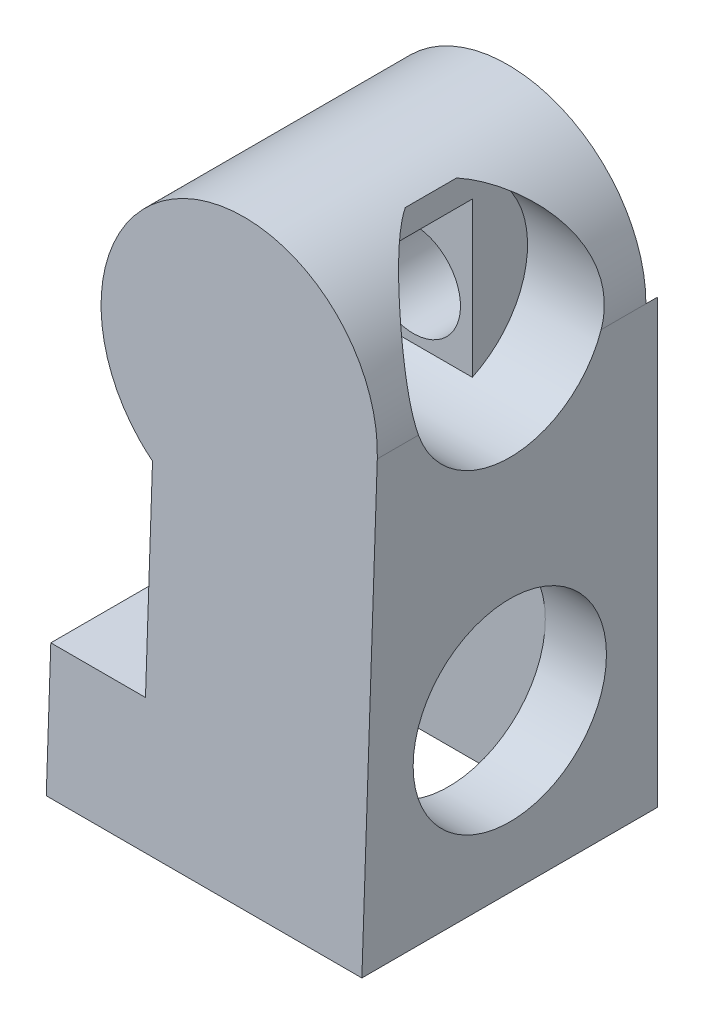
ISO-10303-21;
HEADER;
FILE_DESCRIPTION(('STEP AP214'),'2;1');
FILE_NAME('part.step','',(''),(''),'','','');
FILE_SCHEMA(('AUTOMOTIVE_DESIGN { 1 0 10303 214 1 1 1 1 }'));
ENDSEC;
DATA;
#1=APPLICATION_CONTEXT('core data for automotive mechanical design processes');
#2=APPLICATION_PROTOCOL_DEFINITION('international standard','automotive_design',2000,#1);
#3=PRODUCT_CONTEXT('',#1,'mechanical');
#4=PRODUCT('Part','Part','',(#3));
#5=PRODUCT_RELATED_PRODUCT_CATEGORY('part','',(#4));
#6=PRODUCT_DEFINITION_FORMATION('','',#4);
#7=PRODUCT_DEFINITION_CONTEXT('part definition',#1,'design');
#8=PRODUCT_DEFINITION('design','',#6,#7);
#9=PRODUCT_DEFINITION_SHAPE('','',#8);
#10=(LENGTH_UNIT() NAMED_UNIT(*) SI_UNIT(.MILLI.,.METRE.));
#11=(NAMED_UNIT(*) PLANE_ANGLE_UNIT() SI_UNIT($,.RADIAN.));
#12=(NAMED_UNIT(*) SI_UNIT($,.STERADIAN.) SOLID_ANGLE_UNIT());
#13=UNCERTAINTY_MEASURE_WITH_UNIT(LENGTH_MEASURE(1.E-05),#10,'distance_accuracy_value','');
#14=(GEOMETRIC_REPRESENTATION_CONTEXT(3) GLOBAL_UNCERTAINTY_ASSIGNED_CONTEXT((#13)) GLOBAL_UNIT_ASSIGNED_CONTEXT((#10,
#11,#12)) REPRESENTATION_CONTEXT('',''));
#15=CARTESIAN_POINT('',(0.,0.,0.));
#16=DIRECTION('',(0.,0.,1.));
#17=DIRECTION('',(1.,0.,0.));
#18=AXIS2_PLACEMENT_3D('',#15,#16,#17);
#19=CARTESIAN_POINT('',(6.,12.,3.75));
#20=DIRECTION('',(1.,0.,0.));
#21=DIRECTION('',(0.,0.,-1.));
#22=AXIS2_PLACEMENT_3D('',#19,#20,#21);
#23=PLANE('',#22);
#24=DIRECTION('',(0.,1.,0.));
#25=VECTOR('',#24,1.);
#26=CARTESIAN_POINT('',(6.,13.7,2.7));
#27=LINE('',#26,#25);
#28=CARTESIAN_POINT('',(6.,9.78640563788213,2.7));
#29=VERTEX_POINT('',#28);
#30=CARTESIAN_POINT('',(6.,13.7,2.7));
#31=VERTEX_POINT('',#30);
#32=EDGE_CURVE('E220',#29,#31,#27,.T.);
#33=ORIENTED_EDGE('',*,*,#32,.F.);
#34=CARTESIAN_POINT('',(6.,12.,3.75));
#35=DIRECTION('',(1.,0.,0.));
#36=DIRECTION('',(0.,0.,-1.));
#37=AXIS2_PLACEMENT_3D('',#34,#35,#36);
#38=CIRCLE('',#37,2.45);
#39=CARTESIAN_POINT('',(6.,14.3622776601684,3.10027370665071));
#40=VERTEX_POINT('',#39);
#41=EDGE_CURVE('E228',#29,#40,#38,.T.);
#42=ORIENTED_EDGE('',*,*,#41,.T.);
#43=DIRECTION('',(0.,0.,-1.));
#44=VECTOR('',#43,1.);
#45=CARTESIAN_POINT('',(6.,14.3622776601684,7.5));
#46=LINE('',#45,#44);
#47=CARTESIAN_POINT('',(6.,14.3622776601684,4.39972629334929));
#48=VERTEX_POINT('',#47);
#49=EDGE_CURVE('E231',#40,#48,#46,.F.);
#50=ORIENTED_EDGE('',*,*,#49,.T.);
#51=CARTESIAN_POINT('',(6.,13.7,5.51422787643774));
#52=VERTEX_POINT('',#51);
#53=EDGE_CURVE('E225',#48,#52,#38,.T.);
#54=ORIENTED_EDGE('',*,*,#53,.T.);
#55=DIRECTION('',(0.,0.,1.));
#56=VECTOR('',#55,1.);
#57=CARTESIAN_POINT('',(6.,13.7,5.51422787643774));
#58=LINE('',#57,#56);
#59=EDGE_CURVE('E210',#31,#52,#58,.T.);
#60=ORIENTED_EDGE('',*,*,#59,.F.);
#61=EDGE_LOOP('',(#33,#42,#50,#54,#60));
#62=FACE_BOUND('',#61,.T.);
#63=ADVANCED_FACE('F60',(#62),#23,.T.);
#64=CARTESIAN_POINT('',(0.,0.,0.));
#65=DIRECTION('',(0.,0.,1.));
#66=DIRECTION('',(1.,0.,0.));
#67=AXIS2_PLACEMENT_3D('',#64,#65,#66);
#68=PLANE('',#67);
#69=CARTESIAN_POINT('',(4.5,11.2,0.));
#70=DIRECTION('',(0.,0.,1.));
#71=DIRECTION('',(1.,0.,0.));
#72=AXIS2_PLACEMENT_3D('',#69,#70,#71);
#73=CIRCLE('',#72,3.5);
#74=CARTESIAN_POINT('',(2.4,8.4,0.));
#75=VERTEX_POINT('',#74);
#76=CARTESIAN_POINT('',(8.,11.2,0.));
#77=VERTEX_POINT('',#76);
#78=EDGE_CURVE('E415',#75,#77,#73,.T.);
#79=ORIENTED_EDGE('',*,*,#78,.T.);
#80=DIRECTION('',(0.,1.,0.));
#81=VECTOR('',#80,1.);
#82=CARTESIAN_POINT('',(8.,0.,0.));
#83=LINE('',#82,#81);
#84=CARTESIAN_POINT('',(8.,0.,0.));
#85=VERTEX_POINT('',#84);
#86=EDGE_CURVE('E304',#85,#77,#83,.T.);
#87=ORIENTED_EDGE('',*,*,#86,.F.);
#88=DIRECTION('',(1.,0.,0.));
#89=VECTOR('',#88,1.);
#90=CARTESIAN_POINT('',(0.,0.,0.));
#91=LINE('',#90,#89);
#92=CARTESIAN_POINT('',(0.,0.,0.));
#93=VERTEX_POINT('',#92);
#94=EDGE_CURVE('E635',#93,#85,#91,.T.);
#95=ORIENTED_EDGE('',*,*,#94,.F.);
#96=DIRECTION('',(0.,-1.,0.));
#97=VECTOR('',#96,1.);
#98=CARTESIAN_POINT('',(0.,0.,0.));
#99=LINE('',#98,#97);
#100=CARTESIAN_POINT('',(0.,3.3,0.));
#101=VERTEX_POINT('',#100);
#102=EDGE_CURVE('E631',#101,#93,#99,.T.);
#103=ORIENTED_EDGE('',*,*,#102,.F.);
#104=DIRECTION('',(-1.,0.,0.));
#105=VECTOR('',#104,1.);
#106=CARTESIAN_POINT('',(0.,3.3,0.));
#107=LINE('',#106,#105);
#108=CARTESIAN_POINT('',(2.4,3.3,0.));
#109=VERTEX_POINT('',#108);
#110=EDGE_CURVE('E626',#109,#101,#107,.T.);
#111=ORIENTED_EDGE('',*,*,#110,.F.);
#112=DIRECTION('',(0.,-1.,0.));
#113=VECTOR('',#112,1.);
#114=CARTESIAN_POINT('',(2.4,0.,0.));
#115=LINE('',#114,#113);
#116=EDGE_CURVE('E308',#75,#109,#115,.T.);
#117=ORIENTED_EDGE('',*,*,#116,.F.);
#118=EDGE_LOOP('',(#79,#87,#95,#103,#111,#117));
#119=FACE_BOUND('',#118,.T.);
#120=ADVANCED_FACE('F360',(#119),#68,.F.);
#121=CARTESIAN_POINT('',(6.45,2.5,6.2));
#122=DIRECTION('',(1.,0.,0.));
#123=DIRECTION('',(0.,0.,-1.));
#124=AXIS2_PLACEMENT_3D('',#121,#122,#123);
#125=PLANE('',#124);
#126=DIRECTION('',(0.,-1.,0.));
#127=VECTOR('',#126,1.);
#128=CARTESIAN_POINT('',(6.45,2.5,1.3));
#129=LINE('',#128,#127);
#130=CARTESIAN_POINT('',(6.45,8.8,1.3));
#131=VERTEX_POINT('',#130);
#132=CARTESIAN_POINT('',(6.45,4.,1.3));
#133=VERTEX_POINT('',#132);
#134=EDGE_CURVE('E660',#131,#133,#129,.T.);
#135=ORIENTED_EDGE('',*,*,#134,.T.);
#136=CARTESIAN_POINT('',(6.45,4.,3.75));
#137=DIRECTION('',(1.,0.,0.));
#138=DIRECTION('',(0.,0.,-1.));
#139=AXIS2_PLACEMENT_3D('',#136,#137,#138);
#140=CIRCLE('',#139,2.45);
#141=CARTESIAN_POINT('',(6.45,4.,6.2));
#142=VERTEX_POINT('',#141);
#143=EDGE_CURVE('E249',#133,#142,#140,.T.);
#144=ORIENTED_EDGE('',*,*,#143,.T.);
#145=DIRECTION('',(0.,-1.,0.));
#146=VECTOR('',#145,1.);
#147=CARTESIAN_POINT('',(6.45,2.5,6.2));
#148=LINE('',#147,#146);
#149=CARTESIAN_POINT('',(6.45,8.8,6.2));
#150=VERTEX_POINT('',#149);
#151=EDGE_CURVE('E656',#150,#142,#148,.T.);
#152=ORIENTED_EDGE('',*,*,#151,.F.);
#153=DIRECTION('',(0.,0.,1.));
#154=VECTOR('',#153,1.);
#155=CARTESIAN_POINT('',(6.45,8.8,6.2));
#156=LINE('',#155,#154);
#157=EDGE_CURVE('E257',#131,#150,#156,.T.);
#158=ORIENTED_EDGE('',*,*,#157,.F.);
#159=EDGE_LOOP('',(#135,#144,#152,#158));
#160=FACE_BOUND('',#159,.T.);
#161=ADVANCED_FACE('F353',(#160),#125,.F.);
#162=CARTESIAN_POINT('',(2.4,0.,7.5));
#163=DIRECTION('',(1.,0.,0.));
#164=DIRECTION('',(0.,1.,0.));
#165=AXIS2_PLACEMENT_3D('',#162,#163,#164);
#166=PLANE('',#165);
#167=ORIENTED_EDGE('',*,*,#116,.T.);
#168=DIRECTION('',(0.,0.,-1.));
#169=VECTOR('',#168,1.);
#170=CARTESIAN_POINT('',(2.4,3.3,7.5));
#171=LINE('',#170,#169);
#172=CARTESIAN_POINT('',(2.4,3.3,7.38476146067723));
#173=VERTEX_POINT('',#172);
#174=EDGE_CURVE('E618',#173,#109,#171,.T.);
#175=ORIENTED_EDGE('',*,*,#174,.F.);
#176=DIRECTION('',(0.,-0.999390827019096,0.034899496702501));
#177=VECTOR('',#176,1.);
#178=CARTESIAN_POINT('',(2.4,0.,7.5));
#179=LINE('',#178,#177);
#180=CARTESIAN_POINT('',(2.4,8.4,7.20666553626932));
#181=VERTEX_POINT('',#180);
#182=EDGE_CURVE('E302',#181,#173,#179,.T.);
#183=ORIENTED_EDGE('',*,*,#182,.F.);
#184=DIRECTION('',(0.,0.,-1.));
#185=VECTOR('',#184,1.);
#186=CARTESIAN_POINT('',(2.4,8.4,7.5));
#187=LINE('',#186,#185);
#188=CARTESIAN_POINT('',(2.4,8.4,0.299999999999998));
#189=VERTEX_POINT('',#188);
#190=EDGE_CURVE('E283',#181,#189,#187,.T.);
#191=ORIENTED_EDGE('',*,*,#190,.T.);
#192=EDGE_CURVE('E286',#189,#75,#187,.T.);
#193=ORIENTED_EDGE('',*,*,#192,.T.);
#194=EDGE_LOOP('',(#167,#175,#183,#191,#193));
#195=FACE_BOUND('',#194,.T.);
#196=ADVANCED_FACE('F378',(#195),#166,.F.);
#197=CARTESIAN_POINT('',(0.,3.3,7.5));
#198=DIRECTION('',(0.,-1.,0.));
#199=DIRECTION('',(1.,0.,0.));
#200=AXIS2_PLACEMENT_3D('',#197,#198,#199);
#201=PLANE('',#200);
#202=ORIENTED_EDGE('',*,*,#110,.T.);
#203=DIRECTION('',(0.,0.,-1.));
#204=VECTOR('',#203,1.);
#205=CARTESIAN_POINT('',(0.,3.3,7.5));
#206=LINE('',#205,#204);
#207=CARTESIAN_POINT('',(0.,3.3,7.38476146067723));
#208=VERTEX_POINT('',#207);
#209=EDGE_CURVE('E624',#208,#101,#206,.T.);
#210=ORIENTED_EDGE('',*,*,#209,.F.);
#211=DIRECTION('',(-1.,0.,0.));
#212=VECTOR('',#211,1.);
#213=CARTESIAN_POINT('',(0.,3.3,7.38476146067723));
#214=LINE('',#213,#212);
#215=EDGE_CURVE('E300',#173,#208,#214,.T.);
#216=ORIENTED_EDGE('',*,*,#215,.F.);
#217=ORIENTED_EDGE('',*,*,#174,.T.);
#218=EDGE_LOOP('',(#202,#210,#216,#217));
#219=FACE_BOUND('',#218,.T.);
#220=ADVANCED_FACE('F375',(#219),#201,.F.);
#221=CARTESIAN_POINT('',(0.,0.,7.5));
#222=DIRECTION('',(1.,0.,0.));
#223=DIRECTION('',(0.,0.,-1.));
#224=AXIS2_PLACEMENT_3D('',#221,#222,#223);
#225=PLANE('',#224);
#226=ORIENTED_EDGE('',*,*,#102,.T.);
#227=DIRECTION('',(0.,0.,-1.));
#228=VECTOR('',#227,1.);
#229=CARTESIAN_POINT('',(0.,0.,7.5));
#230=LINE('',#229,#228);
#231=CARTESIAN_POINT('',(0.,0.,7.5));
#232=VERTEX_POINT('',#231);
#233=EDGE_CURVE('E628',#232,#93,#230,.T.);
#234=ORIENTED_EDGE('',*,*,#233,.F.);
#235=DIRECTION('',(0.,-0.999390827019096,0.034899496702501));
#236=VECTOR('',#235,1.);
#237=CARTESIAN_POINT('',(0.,0.,7.5));
#238=LINE('',#237,#236);
#239=EDGE_CURVE('E298',#208,#232,#238,.T.);
#240=ORIENTED_EDGE('',*,*,#239,.F.);
#241=ORIENTED_EDGE('',*,*,#209,.T.);
#242=EDGE_LOOP('',(#226,#234,#240,#241));
#243=FACE_BOUND('',#242,.T.);
#244=ADVANCED_FACE('F371',(#243),#225,.F.);
#245=CARTESIAN_POINT('',(0.,0.,7.5));
#246=DIRECTION('',(0.,1.,0.));
#247=DIRECTION('',(0.,0.,1.));
#248=AXIS2_PLACEMENT_3D('',#245,#246,#247);
#249=PLANE('',#248);
#250=DIRECTION('',(1.,0.,0.));
#251=VECTOR('',#250,1.);
#252=CARTESIAN_POINT('',(1.55,0.,1.3));
#253=LINE('',#252,#251);
#254=CARTESIAN_POINT('',(1.55,0.,1.3));
#255=VERTEX_POINT('',#254);
#256=CARTESIAN_POINT('',(6.45,0.,1.3));
#257=VERTEX_POINT('',#256);
#258=EDGE_CURVE('E646',#255,#257,#253,.T.);
#259=ORIENTED_EDGE('',*,*,#258,.F.);
#260=DIRECTION('',(0.,0.,-1.));
#261=VECTOR('',#260,1.);
#262=CARTESIAN_POINT('',(1.55,0.,6.2));
#263=LINE('',#262,#261);
#264=CARTESIAN_POINT('',(1.55,0.,6.2));
#265=VERTEX_POINT('',#264);
#266=EDGE_CURVE('E277',#265,#255,#263,.T.);
#267=ORIENTED_EDGE('',*,*,#266,.F.);
#268=DIRECTION('',(-1.,0.,0.));
#269=VECTOR('',#268,1.);
#270=CARTESIAN_POINT('',(1.55,0.,6.2));
#271=LINE('',#270,#269);
#272=CARTESIAN_POINT('',(6.45,0.,6.2));
#273=VERTEX_POINT('',#272);
#274=EDGE_CURVE('E652',#273,#265,#271,.T.);
#275=ORIENTED_EDGE('',*,*,#274,.F.);
#276=DIRECTION('',(0.,0.,1.));
#277=VECTOR('',#276,1.);
#278=CARTESIAN_POINT('',(6.45,0.,6.2));
#279=LINE('',#278,#277);
#280=EDGE_CURVE('E649',#257,#273,#279,.T.);
#281=ORIENTED_EDGE('',*,*,#280,.F.);
#282=EDGE_LOOP('',(#259,#267,#275,#281));
#283=FACE_BOUND('',#282,.T.);
#284=ORIENTED_EDGE('',*,*,#94,.T.);
#285=DIRECTION('',(0.,0.,-1.));
#286=VECTOR('',#285,1.);
#287=CARTESIAN_POINT('',(8.,0.,7.5));
#288=LINE('',#287,#286);
#289=CARTESIAN_POINT('',(8.,0.,7.5));
#290=VERTEX_POINT('',#289);
#291=EDGE_CURVE('E290',#290,#85,#288,.T.);
#292=ORIENTED_EDGE('',*,*,#291,.F.);
#293=DIRECTION('',(1.,0.,0.));
#294=VECTOR('',#293,1.);
#295=CARTESIAN_POINT('',(0.,0.,7.5));
#296=LINE('',#295,#294);
#297=EDGE_CURVE('E296',#232,#290,#296,.T.);
#298=ORIENTED_EDGE('',*,*,#297,.F.);
#299=ORIENTED_EDGE('',*,*,#233,.T.);
#300=EDGE_LOOP('',(#284,#292,#298,#299));
#301=FACE_BOUND('',#300,.T.);
#302=ADVANCED_FACE('F367',(#283,#301),#249,.F.);
#303=CARTESIAN_POINT('',(8.,0.,7.5));
#304=DIRECTION('',(-1.,0.,0.));
#305=DIRECTION('',(0.,0.,1.));
#306=AXIS2_PLACEMENT_3D('',#303,#304,#305);
#307=PLANE('',#306);
#308=CARTESIAN_POINT('',(8.,4.,3.75));
#309=DIRECTION('',(1.,0.,0.));
#310=DIRECTION('',(0.,0.,-1.));
#311=AXIS2_PLACEMENT_3D('',#308,#309,#310);
#312=CIRCLE('',#311,2.45);
#313=CARTESIAN_POINT('',(8.,4.,1.3));
#314=VERTEX_POINT('',#313);
#315=EDGE_CURVE('E232',#314,#314,#312,.T.);
#316=ORIENTED_EDGE('',*,*,#315,.F.);
#317=EDGE_LOOP('',(#316));
#318=FACE_BOUND('',#317,.T.);
#319=DIRECTION('',(0.,0.,-1.));
#320=VECTOR('',#319,1.);
#321=CARTESIAN_POINT('',(8.,11.2,7.5));
#322=LINE('',#321,#320);
#323=CARTESIAN_POINT('',(8.,11.2,1.43429276461812));
#324=VERTEX_POINT('',#323);
#325=CARTESIAN_POINT('',(8.,11.2,0.299999999999998));
#326=VERTEX_POINT('',#325);
#327=EDGE_CURVE('E291',#324,#326,#322,.T.);
#328=ORIENTED_EDGE('',*,*,#327,.F.);
#329=CARTESIAN_POINT('',(8.,12.,3.75));
#330=DIRECTION('',(1.,0.,0.));
#331=DIRECTION('',(0.,0.,-1.));
#332=AXIS2_PLACEMENT_3D('',#329,#330,#331);
#333=CIRCLE('',#332,2.45);
#334=CARTESIAN_POINT('',(8.,11.2,6.06570723538188));
#335=VERTEX_POINT('',#334);
#336=EDGE_CURVE('E238',#335,#324,#333,.T.);
#337=ORIENTED_EDGE('',*,*,#336,.F.);
#338=CARTESIAN_POINT('',(8.,11.2,7.10888738169242));
#339=VERTEX_POINT('',#338);
#340=EDGE_CURVE('E287',#339,#335,#322,.T.);
#341=ORIENTED_EDGE('',*,*,#340,.F.);
#342=DIRECTION('',(0.,0.999390827019096,-0.034899496702501));
#343=VECTOR('',#342,1.);
#344=CARTESIAN_POINT('',(8.,0.,7.5));
#345=LINE('',#344,#343);
#346=EDGE_CURVE('E293',#290,#339,#345,.T.);
#347=ORIENTED_EDGE('',*,*,#346,.F.);
#348=ORIENTED_EDGE('',*,*,#291,.T.);
#349=ORIENTED_EDGE('',*,*,#86,.T.);
#350=EDGE_CURVE('E292',#326,#77,#322,.T.);
#351=ORIENTED_EDGE('',*,*,#350,.F.);
#352=EDGE_LOOP('',(#328,#337,#341,#347,#348,#349,#351));
#353=FACE_BOUND('',#352,.T.);
#354=ADVANCED_FACE('F364',(#318,#353),#307,.F.);
#355=CARTESIAN_POINT('',(0.,0.,7.5));
#356=DIRECTION('',(0.,0.034899496702501,0.999390827019096));
#357=DIRECTION('',(0.,-0.999390827019096,0.034899496702501));
#358=AXIS2_PLACEMENT_3D('',#355,#356,#357);
#359=PLANE('',#358);
#360=ORIENTED_EDGE('',*,*,#346,.T.);
#361=CARTESIAN_POINT('',(4.5,11.2,7.10888738169242));
#362=DIRECTION('',(0.,0.034899496702501,0.999390827019096));
#363=DIRECTION('',(0.,0.999390827019096,-0.034899496702501));
#364=AXIS2_PLACEMENT_3D('',#361,#362,#363);
#365=ELLIPSE('',#364,3.50213340504588,3.5);
#366=EDGE_CURVE('E305',#339,#181,#365,.T.);
#367=ORIENTED_EDGE('',*,*,#366,.T.);
#368=ORIENTED_EDGE('',*,*,#182,.T.);
#369=ORIENTED_EDGE('',*,*,#215,.T.);
#370=ORIENTED_EDGE('',*,*,#239,.T.);
#371=ORIENTED_EDGE('',*,*,#297,.T.);
#372=EDGE_LOOP('',(#360,#367,#368,#369,#370,#371));
#373=FACE_BOUND('',#372,.T.);
#374=ADVANCED_FACE('F62',(#373),#359,.T.);
#375=CARTESIAN_POINT('',(4.5,11.2,7.5));
#376=DIRECTION('',(0.,0.,-1.));
#377=DIRECTION('',(-1.,0.,0.));
#378=AXIS2_PLACEMENT_3D('',#375,#376,#377);
#379=CYLINDRICAL_SURFACE('',#378,3.5);
#380=ORIENTED_EDGE('',*,*,#327,.T.);
#381=CARTESIAN_POINT('',(4.5,11.2,0.299999999999998));
#382=DIRECTION('',(0.,0.,1.));
#383=DIRECTION('',(1.,0.,0.));
#384=AXIS2_PLACEMENT_3D('',#381,#382,#383);
#385=CIRCLE('',#384,3.5);
#386=EDGE_CURVE('E241',#326,#189,#385,.T.);
#387=ORIENTED_EDGE('',*,*,#386,.T.);
#388=ORIENTED_EDGE('',*,*,#190,.F.);
#389=ORIENTED_EDGE('',*,*,#366,.F.);
#390=ORIENTED_EDGE('',*,*,#340,.T.);
#391=CARTESIAN_POINT('',(8.,11.2,6.06570723538188));
#392=CARTESIAN_POINT('',(8.00001066419281,11.2555859724596,6.08492172629228));
#393=CARTESIAN_POINT('',(7.99867598743207,11.311873301131,6.10211542368775));
#394=CARTESIAN_POINT('',(7.9931938501136,11.4254042985271,6.13238900039132));
#395=CARTESIAN_POINT('',(7.9890465825867,11.4826479013588,6.14546916192522));
#396=CARTESIAN_POINT('',(7.97784264718591,11.5973921776251,6.16739628392097));
#397=CARTESIAN_POINT('',(7.97079925227553,11.6548905096612,6.17626216391976));
#398=CARTESIAN_POINT('',(7.95377716670013,11.7699223596169,6.18986152585257));
#399=CARTESIAN_POINT('',(7.94379862460003,11.8274558756085,6.19459521689267));
#400=CARTESIAN_POINT('',(7.90946339606441,11.9994840631924,6.20267975119494));
#401=CARTESIAN_POINT('',(7.88070114926205,12.113468482753,6.19992566014156));
#402=CARTESIAN_POINT('',(7.81235121743177,12.3366656803489,6.17935495230665));
#403=CARTESIAN_POINT('',(7.77275635647266,12.4458752395209,6.16152833449447));
#404=CARTESIAN_POINT('',(7.68269293715746,12.6610030630074,6.11181794869455));
#405=CARTESIAN_POINT('',(7.6318912218797,12.7666708879899,6.07946230786302));
#406=CARTESIAN_POINT('',(7.52222678639467,12.9690196822273,6.00282732321686));
#407=CARTESIAN_POINT('',(7.46336084462865,13.0656970338553,5.95854320725778));
#408=CARTESIAN_POINT('',(7.30705643544795,13.2973284244922,5.8343644022297));
#409=CARTESIAN_POINT('',(7.20547832522688,13.4260428059191,5.7479269721117));
#410=CARTESIAN_POINT('',(7.04660840941317,13.6023148393344,5.60495369158686));
#411=CARTESIAN_POINT('',(6.99243340246129,13.6583837250561,5.5549435311814));
#412=CARTESIAN_POINT('',(6.88258005771902,13.7649860379074,5.45084303835125));
#413=CARTESIAN_POINT('',(6.82690226491794,13.8155214390236,5.39675417264685));
#414=CARTESIAN_POINT('',(6.71338315000754,13.912312245943,5.2833809641533));
#415=CARTESIAN_POINT('',(6.65552219505235,13.9584330243329,5.22400201287864));
#416=CARTESIAN_POINT('',(6.53983908198178,14.045043019041,5.10127312013026));
#417=CARTESIAN_POINT('',(6.48201691736452,14.0855340885884,5.03792449543251));
#418=CARTESIAN_POINT('',(6.3677930209355,14.1607436625587,4.9073005132432));
#419=CARTESIAN_POINT('',(6.31138592510411,14.1954881905756,4.84004483226411));
#420=CARTESIAN_POINT('',(6.20138967305511,14.2592956748146,4.70076400227527));
#421=CARTESIAN_POINT('',(6.14779699436374,14.288365863109,4.62874508303236));
#422=CARTESIAN_POINT('',(6.08012598136603,14.3230703280027,4.52880586101317));
#423=CARTESIAN_POINT('',(6.06353299620449,14.3314040111069,4.5035099689439));
#424=CARTESIAN_POINT('',(6.03113223920953,14.3473735036815,4.45218263850551));
#425=CARTESIAN_POINT('',(6.01532496613916,14.355008872387,4.42615074897101));
#426=CARTESIAN_POINT('',(6.,14.3622776601684,4.39972629334929));
#427=B_SPLINE_CURVE_WITH_KNOTS('',3,(#391,#392,#393,#394,#395,#396,#397,#398,#399,#400,#401,
#402,#403,#404,#405,#406,#407,#408,#409,#410,#411,#412,#413,#414,#415,#416,#417,#418,#419,#420,
#421,#422,#423,#424,#425,#426),.UNSPECIFIED.,.F.,.F.,(4,2,2,2,2,2,2,2,2,2,2,2,2,2,2,2,2,4),(0.,
0.176389244501176,0.352766384462628,0.52834404076466,0.703912811586333,1.05486249179244,
1.40604521954879,1.76956623862622,2.13323290565664,2.68601779787751,2.9637141711236,
3.24131115543474,3.52568598146468,3.80996697210936,4.09292306958182,4.37551614408389,
4.46963180188713,4.56380645982924),.UNSPECIFIED.);
#428=EDGE_CURVE('E13',#335,#48,#427,.T.);
#429=ORIENTED_EDGE('',*,*,#428,.T.);
#430=ORIENTED_EDGE('',*,*,#49,.F.);
#431=CARTESIAN_POINT('',(6.,14.3622776601684,3.10027370665071));
#432=CARTESIAN_POINT('',(6.02565340789794,14.3501187814284,3.0561129168611));
#433=CARTESIAN_POINT('',(6.05259341984377,14.3369490446843,3.01302812850763));
#434=CARTESIAN_POINT('',(6.10837800504377,14.3087102229337,2.92881592970245));
#435=CARTESIAN_POINT('',(6.1372206174035,14.2936430793437,2.88768657688925));
#436=CARTESIAN_POINT('',(6.1961383208396,14.2617381574981,2.80718134697281));
#437=CARTESIAN_POINT('',(6.22621087103671,14.2449039271733,2.76780217400536));
#438=CARTESIAN_POINT('',(6.28724197720783,14.209486966541,2.69053140566553));
#439=CARTESIAN_POINT('',(6.31820079168116,14.1909037224023,2.65264025211125));
#440=CARTESIAN_POINT('',(6.41218538545477,14.1324049495322,2.54067232258956));
#441=CARTESIAN_POINT('',(6.476056395877,14.0898800098068,2.46864959622902));
#442=CARTESIAN_POINT('',(6.60424652029414,13.9979252020629,2.32952721506645));
#443=CARTESIAN_POINT('',(6.66856585217075,13.9484917165048,2.26243016776908));
#444=CARTESIAN_POINT('',(6.78880568564041,13.8489090914714,2.14082212998378));
#445=CARTESIAN_POINT('',(6.84481740360096,13.7995404695367,2.08576230094961));
#446=CARTESIAN_POINT('',(6.95547730273101,13.6952775586961,1.9796712110384));
#447=CARTESIAN_POINT('',(7.01012579485157,13.6403845445518,1.92863902560378));
#448=CARTESIAN_POINT('',(7.11728992076444,13.525075360515,1.83105836403579));
#449=CARTESIAN_POINT('',(7.16980940457081,13.4646698674935,1.784501564524));
#450=CARTESIAN_POINT('',(7.27210952373784,13.3382289932313,1.69632464250168));
#451=CARTESIAN_POINT('',(7.32189075398967,13.2721948428397,1.65470344543221));
#452=CARTESIAN_POINT('',(7.44246575147188,13.0994560587039,1.55730283463763));
#453=CARTESIAN_POINT('',(7.51107500554515,12.9891427073396,1.50508352733528));
#454=CARTESIAN_POINT('',(7.63761066742282,12.7565507337796,1.41642823989336));
#455=CARTESIAN_POINT('',(7.69554518713992,12.6342813062737,1.37998024622393));
#456=CARTESIAN_POINT('',(7.77251685846022,12.4431607801845,1.33951721126887));
#457=CARTESIAN_POINT('',(7.79662457585845,12.3777834981923,1.32837620971132));
#458=CARTESIAN_POINT('',(7.84105507083502,12.2450995217627,1.3113751596333));
#459=CARTESIAN_POINT('',(7.86137990786358,12.1777939003065,1.30551223094969));
#460=CARTESIAN_POINT('',(7.89796872068918,12.0418780809203,1.29941430450083));
#461=CARTESIAN_POINT('',(7.91423537814343,11.9732687769019,1.29917558044607));
#462=CARTESIAN_POINT('',(7.94255075721787,11.8354483316535,1.30455942939617));
#463=CARTESIAN_POINT('',(7.95460129145753,11.7662374622003,1.31017947941788));
#464=CARTESIAN_POINT('',(7.97656824197193,11.6131026974145,1.32926507469877));
#465=CARTESIAN_POINT('',(7.98547562572354,11.5292007465003,1.34415252699801));
#466=CARTESIAN_POINT('',(7.99426394727624,11.4046049548488,1.37306267477184));
#467=CARTESIAN_POINT('',(7.99643121890712,11.3632681700207,1.38380084141635));
#468=CARTESIAN_POINT('',(7.99929965141643,11.2811691231353,1.40743607810964));
#469=CARTESIAN_POINT('',(8.00000096247472,11.2404068026521,1.42033292686671));
#470=CARTESIAN_POINT('',(8.,11.2,1.43429276461812));
#471=B_SPLINE_CURVE_WITH_KNOTS('',3,(#431,#432,#433,#434,#435,#436,#437,#438,#439,#440,#441,
#442,#443,#444,#445,#446,#447,#448,#449,#450,#451,#452,#453,#454,#455,#456,#457,#458,#459,#460,
#461,#462,#463,#464,#465,#466,#467,#468,#469,#470),.UNSPECIFIED.,.F.,.F.,(4,2,2,2,2,2,2,2,2,2,2,
2,2,2,2,2,2,2,2,4),(0.,0.157398635044291,0.314637509636125,0.47156651140427,0.628541761082652,
0.943862465700609,1.25934890550389,1.53741075389402,1.81540858557553,2.09287896291623,
2.37028881921098,2.78873669963868,3.20686527098015,3.41828746076653,3.62959421066328,
3.840760956358,4.05183680417219,4.308096342826,4.43631671215153,4.56452394533867),.UNSPECIFIED.);
#472=EDGE_CURVE('E69',#40,#324,#471,.T.);
#473=ORIENTED_EDGE('',*,*,#472,.T.);
#474=EDGE_LOOP('',(#380,#387,#388,#389,#390,#429,#430,#473));
#475=FACE_BOUND('',#474,.T.);
#476=ADVANCED_FACE('F318',(#475),#379,.T.);
#477=CARTESIAN_POINT('',(1.55,2.5,6.2));
#478=DIRECTION('',(-1.,0.,0.));
#479=DIRECTION('',(0.,0.,1.));
#480=AXIS2_PLACEMENT_3D('',#477,#478,#479);
#481=PLANE('',#480);
#482=ORIENTED_EDGE('',*,*,#266,.T.);
#483=DIRECTION('',(0.,-1.,0.));
#484=VECTOR('',#483,1.);
#485=CARTESIAN_POINT('',(1.55,2.5,1.3));
#486=LINE('',#485,#484);
#487=CARTESIAN_POINT('',(1.55,2.5,1.3));
#488=VERTEX_POINT('',#487);
#489=EDGE_CURVE('E664',#488,#255,#486,.T.);
#490=ORIENTED_EDGE('',*,*,#489,.F.);
#491=DIRECTION('',(0.,0.,-1.));
#492=VECTOR('',#491,1.);
#493=CARTESIAN_POINT('',(1.55,2.5,6.2));
#494=LINE('',#493,#492);
#495=CARTESIAN_POINT('',(1.55,2.5,6.2));
#496=VERTEX_POINT('',#495);
#497=EDGE_CURVE('E266',#496,#488,#494,.T.);
#498=ORIENTED_EDGE('',*,*,#497,.F.);
#499=DIRECTION('',(0.,-1.,0.));
#500=VECTOR('',#499,1.);
#501=CARTESIAN_POINT('',(1.55,2.5,6.2));
#502=LINE('',#501,#500);
#503=EDGE_CURVE('E309',#496,#265,#502,.T.);
#504=ORIENTED_EDGE('',*,*,#503,.T.);
#505=EDGE_LOOP('',(#482,#490,#498,#504));
#506=FACE_BOUND('',#505,.T.);
#507=ADVANCED_FACE('F348',(#506),#481,.F.);
#508=CARTESIAN_POINT('',(1.55,2.5,6.2));
#509=DIRECTION('',(0.,0.,1.));
#510=DIRECTION('',(1.,0.,0.));
#511=AXIS2_PLACEMENT_3D('',#508,#509,#510);
#512=PLANE('',#511);
#513=ORIENTED_EDGE('',*,*,#151,.T.);
#514=EDGE_CURVE('E659',#142,#273,#148,.T.);
#515=ORIENTED_EDGE('',*,*,#514,.T.);
#516=ORIENTED_EDGE('',*,*,#274,.T.);
#517=ORIENTED_EDGE('',*,*,#503,.F.);
#518=DIRECTION('',(-1.,0.,0.));
#519=VECTOR('',#518,1.);
#520=CARTESIAN_POINT('',(1.55,2.5,6.2));
#521=LINE('',#520,#519);
#522=CARTESIAN_POINT('',(3.45,2.5,6.2));
#523=VERTEX_POINT('',#522);
#524=EDGE_CURVE('E272',#523,#496,#521,.T.);
#525=ORIENTED_EDGE('',*,*,#524,.F.);
#526=DIRECTION('',(0.,-1.,0.));
#527=VECTOR('',#526,1.);
#528=CARTESIAN_POINT('',(3.45,8.8,6.2));
#529=LINE('',#528,#527);
#530=CARTESIAN_POINT('',(3.45,8.8,6.2));
#531=VERTEX_POINT('',#530);
#532=EDGE_CURVE('E275',#531,#523,#529,.T.);
#533=ORIENTED_EDGE('',*,*,#532,.F.);
#534=DIRECTION('',(-1.,0.,0.));
#535=VECTOR('',#534,1.);
#536=CARTESIAN_POINT('',(3.45,8.8,6.2));
#537=LINE('',#536,#535);
#538=EDGE_CURVE('E260',#150,#531,#537,.T.);
#539=ORIENTED_EDGE('',*,*,#538,.F.);
#540=EDGE_LOOP('',(#513,#515,#516,#517,#525,#533,#539));
#541=FACE_BOUND('',#540,.T.);
#542=ADVANCED_FACE('F344',(#541),#512,.F.);
#543=ORIENTED_EDGE('',*,*,#514,.F.);
#544=EDGE_CURVE('E234',#142,#133,#140,.T.);
#545=ORIENTED_EDGE('',*,*,#544,.T.);
#546=EDGE_CURVE('E663',#133,#257,#129,.T.);
#547=ORIENTED_EDGE('',*,*,#546,.T.);
#548=ORIENTED_EDGE('',*,*,#280,.T.);
#549=EDGE_LOOP('',(#543,#545,#547,#548));
#550=FACE_BOUND('',#549,.T.);
#551=ADVANCED_FACE('F347',(#550),#125,.F.);
#552=CARTESIAN_POINT('',(1.55,2.5,1.3));
#553=DIRECTION('',(0.,0.,-1.));
#554=DIRECTION('',(-1.,0.,0.));
#555=AXIS2_PLACEMENT_3D('',#552,#553,#554);
#556=PLANE('',#555);
#557=ORIENTED_EDGE('',*,*,#546,.F.);
#558=ORIENTED_EDGE('',*,*,#134,.F.);
#559=DIRECTION('',(1.,0.,0.));
#560=VECTOR('',#559,1.);
#561=CARTESIAN_POINT('',(3.45,8.8,1.3));
#562=LINE('',#561,#560);
#563=CARTESIAN_POINT('',(3.45,8.8,1.3));
#564=VERTEX_POINT('',#563);
#565=EDGE_CURVE('E253',#564,#131,#562,.T.);
#566=ORIENTED_EDGE('',*,*,#565,.F.);
#567=DIRECTION('',(0.,-1.,0.));
#568=VECTOR('',#567,1.);
#569=CARTESIAN_POINT('',(3.45,8.8,1.3));
#570=LINE('',#569,#568);
#571=CARTESIAN_POINT('',(3.45,2.5,1.3));
#572=VERTEX_POINT('',#571);
#573=EDGE_CURVE('E263',#564,#572,#570,.T.);
#574=ORIENTED_EDGE('',*,*,#573,.T.);
#575=DIRECTION('',(1.,0.,0.));
#576=VECTOR('',#575,1.);
#577=CARTESIAN_POINT('',(1.55,2.5,1.3));
#578=LINE('',#577,#576);
#579=EDGE_CURVE('E640',#488,#572,#578,.T.);
#580=ORIENTED_EDGE('',*,*,#579,.F.);
#581=ORIENTED_EDGE('',*,*,#489,.T.);
#582=ORIENTED_EDGE('',*,*,#258,.T.);
#583=EDGE_LOOP('',(#557,#558,#566,#574,#580,#581,#582));
#584=FACE_BOUND('',#583,.T.);
#585=ADVANCED_FACE('F342',(#584),#556,.F.);
#586=CARTESIAN_POINT('',(0.,2.5,0.));
#587=DIRECTION('',(0.,-1.,0.));
#588=DIRECTION('',(0.,0.,-1.));
#589=AXIS2_PLACEMENT_3D('',#586,#587,#588);
#590=PLANE('',#589);
#591=DIRECTION('',(0.,0.,-1.));
#592=VECTOR('',#591,1.);
#593=CARTESIAN_POINT('',(3.45,2.5,6.2));
#594=LINE('',#593,#592);
#595=EDGE_CURVE('E254',#523,#572,#594,.T.);
#596=ORIENTED_EDGE('',*,*,#595,.F.);
#597=ORIENTED_EDGE('',*,*,#524,.T.);
#598=ORIENTED_EDGE('',*,*,#497,.T.);
#599=ORIENTED_EDGE('',*,*,#579,.T.);
#600=EDGE_LOOP('',(#596,#597,#598,#599));
#601=FACE_BOUND('',#600,.T.);
#602=ADVANCED_FACE('F338',(#601),#590,.T.);
#603=CARTESIAN_POINT('',(3.45,8.8,6.2));
#604=DIRECTION('',(-1.,0.,0.));
#605=DIRECTION('',(0.,0.,1.));
#606=AXIS2_PLACEMENT_3D('',#603,#604,#605);
#607=PLANE('',#606);
#608=ORIENTED_EDGE('',*,*,#595,.T.);
#609=ORIENTED_EDGE('',*,*,#573,.F.);
#610=DIRECTION('',(0.,0.,-1.));
#611=VECTOR('',#610,1.);
#612=CARTESIAN_POINT('',(3.45,8.8,6.2));
#613=LINE('',#612,#611);
#614=EDGE_CURVE('E250',#531,#564,#613,.T.);
#615=ORIENTED_EDGE('',*,*,#614,.F.);
#616=ORIENTED_EDGE('',*,*,#532,.T.);
#617=EDGE_LOOP('',(#608,#609,#615,#616));
#618=FACE_BOUND('',#617,.T.);
#619=ADVANCED_FACE('F334',(#618),#607,.F.);
#620=CARTESIAN_POINT('',(0.,8.8,0.));
#621=DIRECTION('',(0.,-1.,0.));
#622=DIRECTION('',(0.,0.,-1.));
#623=AXIS2_PLACEMENT_3D('',#620,#621,#622);
#624=PLANE('',#623);
#625=ORIENTED_EDGE('',*,*,#614,.T.);
#626=ORIENTED_EDGE('',*,*,#565,.T.);
#627=ORIENTED_EDGE('',*,*,#157,.T.);
#628=ORIENTED_EDGE('',*,*,#538,.T.);
#629=EDGE_LOOP('',(#625,#626,#627,#628));
#630=FACE_BOUND('',#629,.T.);
#631=ADVANCED_FACE('F330',(#630),#624,.T.);
#632=CARTESIAN_POINT('',(6.,4.,3.75));
#633=DIRECTION('',(1.,0.,0.));
#634=DIRECTION('',(0.,0.,-1.));
#635=AXIS2_PLACEMENT_3D('',#632,#633,#634);
#636=CYLINDRICAL_SURFACE('',#635,2.45);
#637=ORIENTED_EDGE('',*,*,#315,.T.);
#638=EDGE_LOOP('',(#637));
#639=FACE_BOUND('',#638,.T.);
#640=ORIENTED_EDGE('',*,*,#544,.F.);
#641=ORIENTED_EDGE('',*,*,#143,.F.);
#642=EDGE_LOOP('',(#640,#641));
#643=FACE_BOUND('',#642,.T.);
#644=ADVANCED_FACE('F325',(#639,#643),#636,.F.);
#645=CARTESIAN_POINT('',(6.,12.,3.75));
#646=DIRECTION('',(1.,0.,0.));
#647=DIRECTION('',(0.,0.,-1.));
#648=AXIS2_PLACEMENT_3D('',#645,#646,#647);
#649=CYLINDRICAL_SURFACE('',#648,2.45);
#650=ORIENTED_EDGE('',*,*,#336,.T.);
#651=ORIENTED_EDGE('',*,*,#472,.F.);
#652=ORIENTED_EDGE('',*,*,#41,.F.);
#653=DIRECTION('',(1.,0.,0.));
#654=VECTOR('',#653,1.);
#655=CARTESIAN_POINT('',(-2.001,9.78640563788213,2.7));
#656=LINE('',#655,#654);
#657=CARTESIAN_POINT('',(2.43802255604273,9.78640563788213,2.7));
#658=VERTEX_POINT('',#657);
#659=EDGE_CURVE('E440',#658,#29,#656,.T.);
#660=ORIENTED_EDGE('',*,*,#659,.F.);
#661=CARTESIAN_POINT('',(2.43802255604273,9.78640563788213,2.7));
#662=CARTESIAN_POINT('',(2.45439781461528,9.76251741877759,2.75037503476577));
#663=CARTESIAN_POINT('',(2.47025500879551,9.74027881845354,2.8016875263454));
#664=CARTESIAN_POINT('',(2.50042760848287,9.69921422684821,2.90616952588401));
#665=CARTESIAN_POINT('',(2.51474122383696,9.68039218097329,2.95934109728092));
#666=CARTESIAN_POINT('',(2.55465226885188,9.62916812111359,3.12185322868328));
#667=CARTESIAN_POINT('',(2.57708659704231,9.60219307969136,3.23380488428258));
#668=CARTESIAN_POINT('',(2.60939773327412,9.56406314117034,3.46312510454168));
#669=CARTESIAN_POINT('',(2.61917847762832,9.55302919309986,3.58052817828893));
#670=CARTESIAN_POINT('',(2.62352592827918,9.54807254332745,3.81556736586228));
#671=CARTESIAN_POINT('',(2.61815119187259,9.55408398266473,3.93320083263776));
#672=CARTESIAN_POINT('',(2.59493025937629,9.58106372937509,4.15276003298698));
#673=CARTESIAN_POINT('',(2.57844102888516,9.60040935523592,4.25504588449916));
#674=CARTESIAN_POINT('',(2.53715183499253,9.65135603399639,4.45502362935958));
#675=CARTESIAN_POINT('',(2.51232561823557,9.68299585165166,4.55269988469709));
#676=CARTESIAN_POINT('',(2.44651912480812,9.77261902414771,4.78040576355963));
#677=CARTESIAN_POINT('',(2.40306529527959,9.83608117240362,4.90755605660319));
#678=CARTESIAN_POINT('',(2.31432119640078,9.98337206853187,5.14842299622294));
#679=CARTESIAN_POINT('',(2.2690342376387,10.0671653560456,5.26216252531121));
#680=CARTESIAN_POINT('',(2.21620440589735,10.1827111989763,5.39349859793747));
#681=CARTESIAN_POINT('',(2.20620887535519,10.2054339169294,5.41828248565102));
#682=CARTESIAN_POINT('',(2.1866064667921,10.2519262459768,5.46693582156647));
#683=CARTESIAN_POINT('',(2.17699906724794,10.2756943561148,5.49080649438033));
#684=CARTESIAN_POINT('',(2.16761924206188,10.3,5.51422787643774));
#685=B_SPLINE_CURVE_WITH_KNOTS('',3,(#661,#662,#663,#664,#665,#666,#667,#668,#669,#670,#671,
#672,#673,#674,#675,#676,#677,#678,#679,#680,#681,#682,#683,#684),.UNSPECIFIED.,.F.,.F.,(4,2,2,
2,2,2,2,2,2,2,2,4),(0.,0.174255224533192,0.348710414717565,0.698953247729248,1.05183975138745,
1.40336465303458,1.71828438910083,2.03420526177658,2.477810815863,2.92064815216605,
3.0258632145838,3.13093185061275),.UNSPECIFIED.);
#686=CARTESIAN_POINT('',(2.16761924206188,10.3,5.51422787643774));
#687=VERTEX_POINT('',#686);
#688=EDGE_CURVE('E410',#658,#687,#685,.T.);
#689=ORIENTED_EDGE('',*,*,#688,.T.);
#690=DIRECTION('',(1.,0.,0.));
#691=VECTOR('',#690,1.);
#692=CARTESIAN_POINT('',(-2.001,10.3,5.51422787643774));
#693=LINE('',#692,#691);
#694=CARTESIAN_POINT('',(6.,10.3,5.51422787643774));
#695=VERTEX_POINT('',#694);
#696=EDGE_CURVE('E227',#687,#695,#693,.T.);
#697=ORIENTED_EDGE('',*,*,#696,.T.);
#698=EDGE_CURVE('E219',#52,#695,#38,.T.);
#699=ORIENTED_EDGE('',*,*,#698,.F.);
#700=ORIENTED_EDGE('',*,*,#53,.F.);
#701=ORIENTED_EDGE('',*,*,#428,.F.);
#702=EDGE_LOOP('',(#650,#651,#652,#660,#689,#697,#699,#700,#701));
#703=FACE_BOUND('',#702,.T.);
#704=ADVANCED_FACE('F224',(#703),#649,.F.);
#705=DIRECTION('',(0.,-1.,0.));
#706=VECTOR('',#705,1.);
#707=CARTESIAN_POINT('',(6.,13.7,5.51422787643774));
#708=LINE('',#707,#706);
#709=EDGE_CURVE('E203',#52,#695,#708,.T.);
#710=ORIENTED_EDGE('',*,*,#709,.F.);
#711=ORIENTED_EDGE('',*,*,#698,.T.);
#712=EDGE_LOOP('',(#710,#711));
#713=FACE_BOUND('',#712,.T.);
#714=ADVANCED_FACE('F218',(#713),#23,.T.);
#715=CARTESIAN_POINT('',(4.5,11.2,0.299999999999998));
#716=DIRECTION('',(0.,0.,-1.));
#717=DIRECTION('',(-1.,0.,0.));
#718=AXIS2_PLACEMENT_3D('',#715,#716,#717);
#719=CYLINDRICAL_SURFACE('',#718,3.5);
#720=ORIENTED_EDGE('',*,*,#192,.F.);
#721=EDGE_CURVE('E83',#189,#326,#385,.T.);
#722=ORIENTED_EDGE('',*,*,#721,.T.);
#723=ORIENTED_EDGE('',*,*,#350,.T.);
#724=ORIENTED_EDGE('',*,*,#78,.F.);
#725=EDGE_LOOP('',(#720,#722,#723,#724));
#726=FACE_BOUND('',#725,.T.);
#727=ADVANCED_FACE('F390',(#726),#719,.F.);
#728=CARTESIAN_POINT('',(4.5,11.2,0.299999999999998));
#729=DIRECTION('',(0.,0.,1.));
#730=DIRECTION('',(1.,0.,0.));
#731=AXIS2_PLACEMENT_3D('',#728,#729,#730);
#732=PLANE('',#731);
#733=CARTESIAN_POINT('',(4.5,11.2,0.299999999999998));
#734=DIRECTION('',(0.,0.,-1.));
#735=DIRECTION('',(-1.,0.,0.));
#736=AXIS2_PLACEMENT_3D('',#733,#734,#735);
#737=CIRCLE('',#736,1.2);
#738=CARTESIAN_POINT('',(3.3,11.2,0.299999999999998));
#739=VERTEX_POINT('',#738);
#740=EDGE_CURVE('E432',#739,#739,#737,.T.);
#741=ORIENTED_EDGE('',*,*,#740,.F.);
#742=EDGE_LOOP('',(#741));
#743=FACE_BOUND('',#742,.T.);
#744=ORIENTED_EDGE('',*,*,#386,.F.);
#745=ORIENTED_EDGE('',*,*,#721,.F.);
#746=EDGE_LOOP('',(#744,#745));
#747=FACE_BOUND('',#746,.T.);
#748=ADVANCED_FACE('F394',(#743,#747),#732,.F.);
#749=CARTESIAN_POINT('',(-2.001,13.7,2.7));
#750=DIRECTION('',(0.,0.,-1.));
#751=DIRECTION('',(0.,1.,0.));
#752=AXIS2_PLACEMENT_3D('',#749,#750,#751);
#753=PLANE('',#752);
#754=CARTESIAN_POINT('',(4.5,11.2,2.7));
#755=DIRECTION('',(0.,0.,-1.));
#756=DIRECTION('',(0.,1.,0.));
#757=AXIS2_PLACEMENT_3D('',#754,#755,#756);
#758=CIRCLE('',#757,1.2);
#759=CARTESIAN_POINT('',(4.5,12.4,2.7));
#760=VERTEX_POINT('',#759);
#761=EDGE_CURVE('E64',#760,#760,#758,.T.);
#762=ORIENTED_EDGE('',*,*,#761,.T.);
#763=EDGE_LOOP('',(#762));
#764=FACE_BOUND('',#763,.T.);
#765=ORIENTED_EDGE('',*,*,#659,.T.);
#766=ORIENTED_EDGE('',*,*,#32,.T.);
#767=DIRECTION('',(1.,0.,0.));
#768=VECTOR('',#767,1.);
#769=CARTESIAN_POINT('',(-2.001,13.7,2.7));
#770=LINE('',#769,#768);
#771=CARTESIAN_POINT('',(4.5,13.7,2.7));
#772=VERTEX_POINT('',#771);
#773=EDGE_CURVE('E76',#772,#31,#770,.T.);
#774=ORIENTED_EDGE('',*,*,#773,.F.);
#775=CARTESIAN_POINT('',(4.5,11.2,2.7));
#776=DIRECTION('',(0.,0.,-1.));
#777=DIRECTION('',(0.,1.,0.));
#778=AXIS2_PLACEMENT_3D('',#775,#776,#777);
#779=CIRCLE('',#778,2.5);
#780=EDGE_CURVE('E439',#772,#658,#779,.F.);
#781=ORIENTED_EDGE('',*,*,#780,.T.);
#782=EDGE_LOOP('',(#765,#766,#774,#781));
#783=FACE_BOUND('',#782,.T.);
#784=ADVANCED_FACE('F399',(#764,#783),#753,.F.);
#785=CARTESIAN_POINT('',(-2.001,13.7,5.51422787643774));
#786=DIRECTION('',(0.,0.,1.));
#787=DIRECTION('',(0.,-1.,0.));
#788=AXIS2_PLACEMENT_3D('',#785,#786,#787);
#789=PLANE('',#788);
#790=CARTESIAN_POINT('',(4.5,11.2,5.51422787643774));
#791=DIRECTION('',(0.,0.,1.));
#792=DIRECTION('',(0.,-1.,0.));
#793=AXIS2_PLACEMENT_3D('',#790,#791,#792);
#794=CIRCLE('',#793,2.5);
#795=CARTESIAN_POINT('',(4.5,13.7,5.51422787643774));
#796=VERTEX_POINT('',#795);
#797=EDGE_CURVE('E205',#687,#796,#794,.F.);
#798=ORIENTED_EDGE('',*,*,#797,.T.);
#799=DIRECTION('',(1.,0.,0.));
#800=VECTOR('',#799,1.);
#801=CARTESIAN_POINT('',(-2.001,13.7,5.51422787643774));
#802=LINE('',#801,#800);
#803=EDGE_CURVE('E199',#796,#52,#802,.T.);
#804=ORIENTED_EDGE('',*,*,#803,.T.);
#805=ORIENTED_EDGE('',*,*,#709,.T.);
#806=ORIENTED_EDGE('',*,*,#696,.F.);
#807=EDGE_LOOP('',(#798,#804,#805,#806));
#808=FACE_BOUND('',#807,.T.);
#809=ADVANCED_FACE('F200',(#808),#789,.F.);
#810=CARTESIAN_POINT('',(4.5,11.2,7.5));
#811=DIRECTION('',(0.,0.,-1.));
#812=DIRECTION('',(-1.,0.,0.));
#813=AXIS2_PLACEMENT_3D('',#810,#811,#812);
#814=CYLINDRICAL_SURFACE('',#813,2.5);
#815=ORIENTED_EDGE('',*,*,#797,.F.);
#816=ORIENTED_EDGE('',*,*,#688,.F.);
#817=ORIENTED_EDGE('',*,*,#780,.F.);
#818=DIRECTION('',(0.,0.,-1.));
#819=VECTOR('',#818,1.);
#820=CARTESIAN_POINT('',(4.5,13.7,7.5));
#821=LINE('',#820,#819);
#822=EDGE_CURVE('E207',#772,#796,#821,.F.);
#823=ORIENTED_EDGE('',*,*,#822,.T.);
#824=EDGE_LOOP('',(#815,#816,#817,#823));
#825=FACE_BOUND('',#824,.T.);
#826=ADVANCED_FACE('F405',(#825),#814,.F.);
#827=CARTESIAN_POINT('',(-2.001,13.7,5.51422787643774));
#828=DIRECTION('',(0.,1.,0.));
#829=DIRECTION('',(0.,0.,1.));
#830=AXIS2_PLACEMENT_3D('',#827,#828,#829);
#831=PLANE('',#830);
#832=ORIENTED_EDGE('',*,*,#773,.T.);
#833=ORIENTED_EDGE('',*,*,#59,.T.);
#834=ORIENTED_EDGE('',*,*,#803,.F.);
#835=ORIENTED_EDGE('',*,*,#822,.F.);
#836=EDGE_LOOP('',(#832,#833,#834,#835));
#837=FACE_BOUND('',#836,.T.);
#838=ADVANCED_FACE('F211',(#837),#831,.F.);
#839=CARTESIAN_POINT('',(4.5,11.2,3.6));
#840=DIRECTION('',(0.,0.,-1.));
#841=DIRECTION('',(-1.,0.,0.));
#842=AXIS2_PLACEMENT_3D('',#839,#840,#841);
#843=CYLINDRICAL_SURFACE('',#842,1.2);
#844=ORIENTED_EDGE('',*,*,#740,.T.);
#845=EDGE_LOOP('',(#844));
#846=FACE_BOUND('',#845,.T.);
#847=ORIENTED_EDGE('',*,*,#761,.F.);
#848=EDGE_LOOP('',(#847));
#849=FACE_BOUND('',#848,.T.);
#850=ADVANCED_FACE('F424',(#846,#849),#843,.F.);
#851=CLOSED_SHELL('',(#63,#120,#161,#196,#220,#244,#302,#354,#374,#476,#507,#542,#551,#585,#602,
#619,#631,#644,#704,#714,#727,#748,#784,#809,#826,#838,#850));
#852=MANIFOLD_SOLID_BREP('B2',#851);
#853=ADVANCED_BREP_SHAPE_REPRESENTATION('',(#18,#852),#14);
#854=SHAPE_DEFINITION_REPRESENTATION(#9,#853);
ENDSEC;
END-ISO-10303-21;
